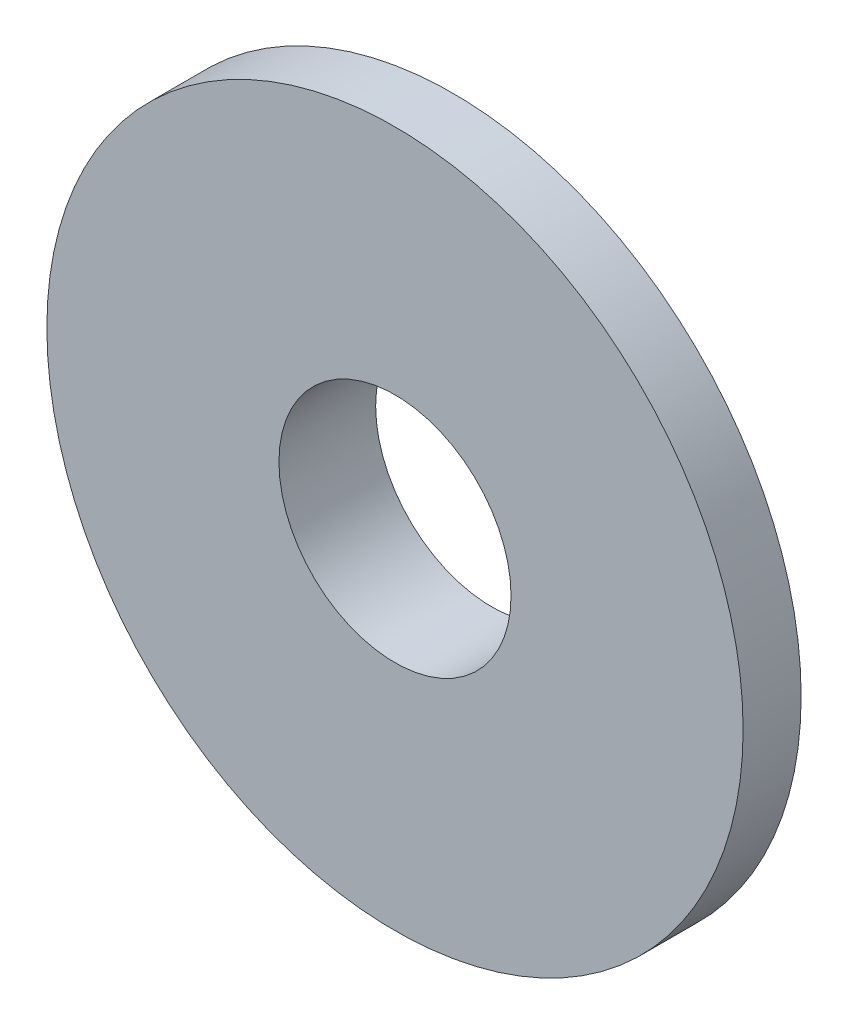
ISO-10303-21;
HEADER;
FILE_DESCRIPTION(('STEP AP214'),'2;1');
FILE_NAME('part.step','',(''),(''),'','','');
FILE_SCHEMA(('AUTOMOTIVE_DESIGN { 1 0 10303 214 1 1 1 1 }'));
ENDSEC;
DATA;
#1=APPLICATION_CONTEXT('core data for automotive mechanical design processes');
#2=APPLICATION_PROTOCOL_DEFINITION('international standard','automotive_design',2000,#1);
#3=PRODUCT_CONTEXT('',#1,'mechanical');
#4=PRODUCT('Part','Part','',(#3));
#5=PRODUCT_RELATED_PRODUCT_CATEGORY('part','',(#4));
#6=PRODUCT_DEFINITION_FORMATION('','',#4);
#7=PRODUCT_DEFINITION_CONTEXT('part definition',#1,'design');
#8=PRODUCT_DEFINITION('design','',#6,#7);
#9=PRODUCT_DEFINITION_SHAPE('','',#8);
#10=(LENGTH_UNIT() NAMED_UNIT(*) SI_UNIT(.MILLI.,.METRE.));
#11=(NAMED_UNIT(*) PLANE_ANGLE_UNIT() SI_UNIT($,.RADIAN.));
#12=(NAMED_UNIT(*) SI_UNIT($,.STERADIAN.) SOLID_ANGLE_UNIT());
#13=UNCERTAINTY_MEASURE_WITH_UNIT(LENGTH_MEASURE(1.E-05),#10,'distance_accuracy_value','');
#14=(GEOMETRIC_REPRESENTATION_CONTEXT(3) GLOBAL_UNCERTAINTY_ASSIGNED_CONTEXT((#13)) GLOBAL_UNIT_ASSIGNED_CONTEXT((#10,
#11,#12)) REPRESENTATION_CONTEXT('',''));
#15=CARTESIAN_POINT('',(0.,0.,0.));
#16=DIRECTION('',(0.,0.,1.));
#17=DIRECTION('',(1.,0.,0.));
#18=AXIS2_PLACEMENT_3D('',#15,#16,#17);
#19=CARTESIAN_POINT('',(3.,0.,0.));
#20=DIRECTION('',(0.,0.,-1.));
#21=DIRECTION('',(-1.,0.,0.));
#22=AXIS2_PLACEMENT_3D('',#19,#20,#21);
#23=PLANE('',#22);
#24=CARTESIAN_POINT('',(0.,0.,0.));
#25=DIRECTION('',(0.,0.,-1.));
#26=DIRECTION('',(-1.,0.,0.));
#27=AXIS2_PLACEMENT_3D('',#24,#25,#26);
#28=CIRCLE('',#27,5.50000000073844);
#29=CARTESIAN_POINT('',(-5.50000000073844,0.,0.));
#30=VERTEX_POINT('',#29);
#31=EDGE_CURVE('E10',#30,#30,#28,.T.);
#32=ORIENTED_EDGE('',*,*,#31,.T.);
#33=EDGE_LOOP('',(#32));
#34=FACE_BOUND('',#33,.T.);
#35=CARTESIAN_POINT('',(0.,0.,0.));
#36=DIRECTION('',(0.,0.,-1.));
#37=DIRECTION('',(-1.,0.,0.));
#38=AXIS2_PLACEMENT_3D('',#35,#36,#37);
#39=CIRCLE('',#38,3.);
#40=CARTESIAN_POINT('',(-3.,0.,0.));
#41=VERTEX_POINT('',#40);
#42=EDGE_CURVE('E49',#41,#41,#39,.T.);
#43=ORIENTED_EDGE('',*,*,#42,.F.);
#44=EDGE_LOOP('',(#43));
#45=FACE_BOUND('',#44,.T.);
#46=ADVANCED_FACE('F30',(#34,#45),#23,.T.);
#47=CARTESIAN_POINT('',(0.,0.,0.));
#48=DIRECTION('',(0.,0.,1.));
#49=DIRECTION('',(1.,0.,0.));
#50=AXIS2_PLACEMENT_3D('',#47,#48,#49);
#51=CONICAL_SURFACE('',#50,5.50000000073844,1.29249666773405);
#52=CARTESIAN_POINT('',(0.,0.,1.));
#53=DIRECTION('',(0.,0.,-1.));
#54=DIRECTION('',(-1.,0.,0.));
#55=AXIS2_PLACEMENT_3D('',#52,#53,#54);
#56=CIRCLE('',#55,9.);
#57=CARTESIAN_POINT('',(-9.,0.,1.));
#58=VERTEX_POINT('',#57);
#59=EDGE_CURVE('E36',#58,#58,#56,.T.);
#60=ORIENTED_EDGE('',*,*,#59,.T.);
#61=EDGE_LOOP('',(#60));
#62=FACE_BOUND('',#61,.T.);
#63=ORIENTED_EDGE('',*,*,#31,.F.);
#64=EDGE_LOOP('',(#63));
#65=FACE_BOUND('',#64,.T.);
#66=ADVANCED_FACE('F57',(#62,#65),#51,.T.);
#67=CARTESIAN_POINT('',(0.,0.,2.5));
#68=DIRECTION('',(0.,0.,-1.));
#69=DIRECTION('',(-1.,0.,0.));
#70=AXIS2_PLACEMENT_3D('',#67,#68,#69);
#71=CYLINDRICAL_SURFACE('',#70,9.);
#72=CARTESIAN_POINT('',(0.,0.,2.5));
#73=DIRECTION('',(0.,0.,-1.));
#74=DIRECTION('',(-1.,0.,0.));
#75=AXIS2_PLACEMENT_3D('',#72,#73,#74);
#76=CIRCLE('',#75,9.);
#77=CARTESIAN_POINT('',(-9.,0.,2.5));
#78=VERTEX_POINT('',#77);
#79=EDGE_CURVE('E40',#78,#78,#76,.T.);
#80=ORIENTED_EDGE('',*,*,#79,.T.);
#81=EDGE_LOOP('',(#80));
#82=FACE_BOUND('',#81,.T.);
#83=ORIENTED_EDGE('',*,*,#59,.F.);
#84=EDGE_LOOP('',(#83));
#85=FACE_BOUND('',#84,.T.);
#86=ADVANCED_FACE('F61',(#82,#85),#71,.T.);
#87=CARTESIAN_POINT('',(9.,0.,2.5));
#88=DIRECTION('',(0.,0.,1.));
#89=DIRECTION('',(1.,0.,0.));
#90=AXIS2_PLACEMENT_3D('',#87,#88,#89);
#91=PLANE('',#90);
#92=CARTESIAN_POINT('',(0.,0.,2.5));
#93=DIRECTION('',(0.,0.,-1.));
#94=DIRECTION('',(-1.,0.,0.));
#95=AXIS2_PLACEMENT_3D('',#92,#93,#94);
#96=CIRCLE('',#95,3.);
#97=CARTESIAN_POINT('',(-3.,0.,2.5));
#98=VERTEX_POINT('',#97);
#99=EDGE_CURVE('E44',#98,#98,#96,.T.);
#100=ORIENTED_EDGE('',*,*,#99,.T.);
#101=EDGE_LOOP('',(#100));
#102=FACE_BOUND('',#101,.T.);
#103=ORIENTED_EDGE('',*,*,#79,.F.);
#104=EDGE_LOOP('',(#103));
#105=FACE_BOUND('',#104,.T.);
#106=ADVANCED_FACE('F65',(#102,#105),#91,.T.);
#107=CARTESIAN_POINT('',(0.,0.,2.5));
#108=DIRECTION('',(0.,0.,-1.));
#109=DIRECTION('',(-1.,0.,0.));
#110=AXIS2_PLACEMENT_3D('',#107,#108,#109);
#111=CYLINDRICAL_SURFACE('',#110,3.);
#112=ORIENTED_EDGE('',*,*,#42,.T.);
#113=EDGE_LOOP('',(#112));
#114=FACE_BOUND('',#113,.T.);
#115=ORIENTED_EDGE('',*,*,#99,.F.);
#116=EDGE_LOOP('',(#115));
#117=FACE_BOUND('',#116,.T.);
#118=ADVANCED_FACE('F53',(#114,#117),#111,.F.);
#119=CLOSED_SHELL('',(#46,#66,#86,#106,#118));
#120=MANIFOLD_SOLID_BREP('B2',#119);
#121=ADVANCED_BREP_SHAPE_REPRESENTATION('',(#18,#120),#14);
#122=SHAPE_DEFINITION_REPRESENTATION(#9,#121);
ENDSEC;
END-ISO-10303-21;
